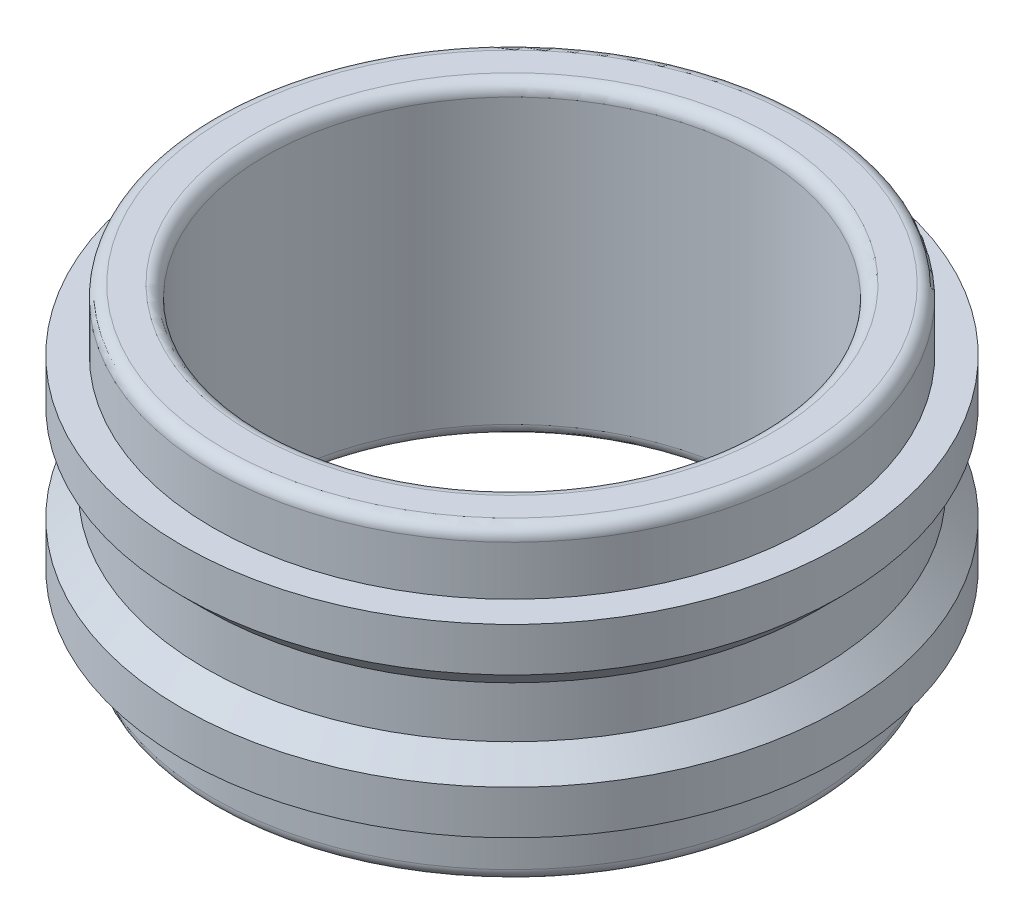
ISO-10303-21;
HEADER;
FILE_DESCRIPTION(('STEP AP214'),'2;1');
FILE_NAME('part.step','',(''),(''),'','','');
FILE_SCHEMA(('AUTOMOTIVE_DESIGN { 1 0 10303 214 1 1 1 1 }'));
ENDSEC;
DATA;
#1=APPLICATION_CONTEXT('core data for automotive mechanical design processes');
#2=APPLICATION_PROTOCOL_DEFINITION('international standard','automotive_design',2000,#1);
#3=PRODUCT_CONTEXT('',#1,'mechanical');
#4=PRODUCT('Part','Part','',(#3));
#5=PRODUCT_RELATED_PRODUCT_CATEGORY('part','',(#4));
#6=PRODUCT_DEFINITION_FORMATION('','',#4);
#7=PRODUCT_DEFINITION_CONTEXT('part definition',#1,'design');
#8=PRODUCT_DEFINITION('design','',#6,#7);
#9=PRODUCT_DEFINITION_SHAPE('','',#8);
#10=(LENGTH_UNIT() NAMED_UNIT(*) SI_UNIT(.MILLI.,.METRE.));
#11=(NAMED_UNIT(*) PLANE_ANGLE_UNIT() SI_UNIT($,.RADIAN.));
#12=(NAMED_UNIT(*) SI_UNIT($,.STERADIAN.) SOLID_ANGLE_UNIT());
#13=UNCERTAINTY_MEASURE_WITH_UNIT(LENGTH_MEASURE(1.E-05),#10,'distance_accuracy_value','');
#14=(GEOMETRIC_REPRESENTATION_CONTEXT(3) GLOBAL_UNCERTAINTY_ASSIGNED_CONTEXT((#13)) GLOBAL_UNIT_ASSIGNED_CONTEXT((#10,
#11,#12)) REPRESENTATION_CONTEXT('',''));
#15=CARTESIAN_POINT('',(0.,0.,0.));
#16=DIRECTION('',(0.,0.,1.));
#17=DIRECTION('',(1.,0.,0.));
#18=AXIS2_PLACEMENT_3D('',#15,#16,#17);
#19=CARTESIAN_POINT('',(0.,5.,0.));
#20=DIRECTION('',(0.,-1.,0.));
#21=DIRECTION('',(0.,0.,-1.));
#22=AXIS2_PLACEMENT_3D('',#19,#20,#21);
#23=CYLINDRICAL_SURFACE('',#22,5.35);
#24=CARTESIAN_POINT('',(0.,1.,0.));
#25=DIRECTION('',(0.,1.,0.));
#26=DIRECTION('',(0.,0.,1.));
#27=AXIS2_PLACEMENT_3D('',#24,#25,#26);
#28=CIRCLE('',#27,5.35);
#29=CARTESIAN_POINT('',(0.,1.,5.35));
#30=VERTEX_POINT('',#29);
#31=EDGE_CURVE('E82',#30,#30,#28,.T.);
#32=ORIENTED_EDGE('',*,*,#31,.T.);
#33=EDGE_LOOP('',(#32));
#34=FACE_BOUND('',#33,.T.);
#35=CARTESIAN_POINT('',(0.,1.7107864376269,0.));
#36=DIRECTION('',(0.,-1.,0.));
#37=DIRECTION('',(0.,0.,-1.));
#38=AXIS2_PLACEMENT_3D('',#35,#36,#37);
#39=CIRCLE('',#38,5.35);
#40=CARTESIAN_POINT('',(0.,1.7107864376269,-5.35));
#41=VERTEX_POINT('',#40);
#42=EDGE_CURVE('E69',#41,#41,#39,.F.);
#43=ORIENTED_EDGE('',*,*,#42,.F.);
#44=EDGE_LOOP('',(#43));
#45=FACE_BOUND('',#44,.T.);
#46=ADVANCED_FACE('F36',(#34,#45),#23,.T.);
#47=CARTESIAN_POINT('',(0.,4.,0.));
#48=DIRECTION('',(0.,1.,0.));
#49=DIRECTION('',(0.,0.,1.));
#50=AXIS2_PLACEMENT_3D('',#47,#48,#49);
#51=CIRCLE('',#50,5.35);
#52=CARTESIAN_POINT('',(0.,4.,5.35));
#53=VERTEX_POINT('',#52);
#54=EDGE_CURVE('E68',#53,#53,#51,.T.);
#55=ORIENTED_EDGE('',*,*,#54,.F.);
#56=EDGE_LOOP('',(#55));
#57=FACE_BOUND('',#56,.T.);
#58=CARTESIAN_POINT('',(0.,3.28921356237309,0.));
#59=DIRECTION('',(0.,1.,0.));
#60=DIRECTION('',(0.,0.,1.));
#61=AXIS2_PLACEMENT_3D('',#58,#59,#60);
#62=CIRCLE('',#61,5.35);
#63=CARTESIAN_POINT('',(0.,3.28921356237309,5.35));
#64=VERTEX_POINT('',#63);
#65=EDGE_CURVE('E73',#64,#64,#62,.F.);
#66=ORIENTED_EDGE('',*,*,#65,.F.);
#67=EDGE_LOOP('',(#66));
#68=FACE_BOUND('',#67,.T.);
#69=ADVANCED_FACE('F103',(#57,#68),#23,.T.);
#70=CARTESIAN_POINT('',(0.,0.,0.));
#71=DIRECTION('',(0.,1.,0.));
#72=DIRECTION('',(0.,0.,1.));
#73=AXIS2_PLACEMENT_3D('',#70,#71,#72);
#74=PLANE('',#73);
#75=CARTESIAN_POINT('',(0.,0.,0.));
#76=DIRECTION('',(0.,1.,0.));
#77=DIRECTION('',(0.,0.,1.));
#78=AXIS2_PLACEMENT_3D('',#75,#76,#77);
#79=CIRCLE('',#78,4.2);
#80=CARTESIAN_POINT('',(0.,0.,4.2));
#81=VERTEX_POINT('',#80);
#82=EDGE_CURVE('E62',#81,#81,#79,.T.);
#83=ORIENTED_EDGE('',*,*,#82,.T.);
#84=EDGE_LOOP('',(#83));
#85=FACE_BOUND('',#84,.T.);
#86=CARTESIAN_POINT('',(0.,0.,0.));
#87=DIRECTION('',(0.,1.,0.));
#88=DIRECTION('',(0.,0.,1.));
#89=AXIS2_PLACEMENT_3D('',#86,#87,#88);
#90=CIRCLE('',#89,4.65);
#91=CARTESIAN_POINT('',(0.,0.,4.65));
#92=VERTEX_POINT('',#91);
#93=EDGE_CURVE('E65',#92,#92,#90,.F.);
#94=ORIENTED_EDGE('',*,*,#93,.T.);
#95=EDGE_LOOP('',(#94));
#96=FACE_BOUND('',#95,.T.);
#97=ADVANCED_FACE('F105',(#85,#96),#74,.F.);
#98=CARTESIAN_POINT('',(0.,5.,0.));
#99=DIRECTION('',(0.,1.,0.));
#100=DIRECTION('',(0.,0.,1.));
#101=AXIS2_PLACEMENT_3D('',#98,#99,#100);
#102=PLANE('',#101);
#103=CARTESIAN_POINT('',(0.,5.,0.));
#104=DIRECTION('',(0.,1.,0.));
#105=DIRECTION('',(0.,0.,1.));
#106=AXIS2_PLACEMENT_3D('',#103,#104,#105);
#107=CIRCLE('',#106,4.2);
#108=CARTESIAN_POINT('',(0.,5.,4.2));
#109=VERTEX_POINT('',#108);
#110=EDGE_CURVE('E43',#109,#109,#107,.F.);
#111=ORIENTED_EDGE('',*,*,#110,.T.);
#112=EDGE_LOOP('',(#111));
#113=FACE_BOUND('',#112,.T.);
#114=CARTESIAN_POINT('',(0.,5.,0.));
#115=DIRECTION('',(0.,1.,0.));
#116=DIRECTION('',(0.,0.,1.));
#117=AXIS2_PLACEMENT_3D('',#114,#115,#116);
#118=CIRCLE('',#117,4.65);
#119=CARTESIAN_POINT('',(0.,5.,4.65));
#120=VERTEX_POINT('',#119);
#121=EDGE_CURVE('E47',#120,#120,#118,.T.);
#122=ORIENTED_EDGE('',*,*,#121,.T.);
#123=EDGE_LOOP('',(#122));
#124=FACE_BOUND('',#123,.T.);
#125=ADVANCED_FACE('F112',(#113,#124),#102,.T.);
#126=CARTESIAN_POINT('',(0.,5.,0.));
#127=DIRECTION('',(0.,-1.,0.));
#128=DIRECTION('',(0.,0.,-1.));
#129=AXIS2_PLACEMENT_3D('',#126,#127,#128);
#130=CYLINDRICAL_SURFACE('',#129,4.);
#131=CARTESIAN_POINT('',(0.,0.2,0.));
#132=DIRECTION('',(0.,1.,0.));
#133=DIRECTION('',(0.,0.,1.));
#134=AXIS2_PLACEMENT_3D('',#131,#132,#133);
#135=CIRCLE('',#134,4.);
#136=CARTESIAN_POINT('',(0.,0.2,4.));
#137=VERTEX_POINT('',#136);
#138=EDGE_CURVE('E56',#137,#137,#135,.F.);
#139=ORIENTED_EDGE('',*,*,#138,.T.);
#140=EDGE_LOOP('',(#139));
#141=FACE_BOUND('',#140,.T.);
#142=CARTESIAN_POINT('',(0.,4.8,0.));
#143=DIRECTION('',(0.,1.,0.));
#144=DIRECTION('',(0.,0.,1.));
#145=AXIS2_PLACEMENT_3D('',#142,#143,#144);
#146=CIRCLE('',#145,4.);
#147=CARTESIAN_POINT('',(0.,4.8,4.));
#148=VERTEX_POINT('',#147);
#149=EDGE_CURVE('E59',#148,#148,#146,.T.);
#150=ORIENTED_EDGE('',*,*,#149,.T.);
#151=EDGE_LOOP('',(#150));
#152=FACE_BOUND('',#151,.T.);
#153=ADVANCED_FACE('F136',(#141,#152),#130,.F.);
#154=CARTESIAN_POINT('',(0.,4.,0.));
#155=DIRECTION('',(0.,1.,0.));
#156=DIRECTION('',(0.,0.,1.));
#157=AXIS2_PLACEMENT_3D('',#154,#155,#156);
#158=PLANE('',#157);
#159=CARTESIAN_POINT('',(0.,4.,0.));
#160=DIRECTION('',(0.,1.,0.));
#161=DIRECTION('',(0.,0.,1.));
#162=AXIS2_PLACEMENT_3D('',#159,#160,#161);
#163=CIRCLE('',#162,4.85);
#164=CARTESIAN_POINT('',(0.,4.,4.85));
#165=VERTEX_POINT('',#164);
#166=EDGE_CURVE('E79',#165,#165,#163,.T.);
#167=ORIENTED_EDGE('',*,*,#166,.F.);
#168=EDGE_LOOP('',(#167));
#169=FACE_BOUND('',#168,.T.);
#170=ORIENTED_EDGE('',*,*,#54,.T.);
#171=EDGE_LOOP('',(#170));
#172=FACE_BOUND('',#171,.T.);
#173=ADVANCED_FACE('F138',(#169,#172),#158,.T.);
#174=CARTESIAN_POINT('',(0.,4.,0.));
#175=DIRECTION('',(0.,1.,0.));
#176=DIRECTION('',(0.,0.,1.));
#177=AXIS2_PLACEMENT_3D('',#174,#175,#176);
#178=CYLINDRICAL_SURFACE('',#177,4.85);
#179=CARTESIAN_POINT('',(0.,4.8,0.));
#180=DIRECTION('',(0.,1.,0.));
#181=DIRECTION('',(0.,0.,1.));
#182=AXIS2_PLACEMENT_3D('',#179,#180,#181);
#183=CIRCLE('',#182,4.85);
#184=CARTESIAN_POINT('',(0.,4.8,4.85));
#185=VERTEX_POINT('',#184);
#186=EDGE_CURVE('E10',#185,#185,#183,.F.);
#187=ORIENTED_EDGE('',*,*,#186,.T.);
#188=EDGE_LOOP('',(#187));
#189=FACE_BOUND('',#188,.T.);
#190=ORIENTED_EDGE('',*,*,#166,.T.);
#191=EDGE_LOOP('',(#190));
#192=FACE_BOUND('',#191,.T.);
#193=ADVANCED_FACE('F145',(#189,#192),#178,.T.);
#194=CARTESIAN_POINT('',(0.,1.,0.));
#195=DIRECTION('',(0.,1.,0.));
#196=DIRECTION('',(0.,0.,1.));
#197=AXIS2_PLACEMENT_3D('',#194,#195,#196);
#198=PLANE('',#197);
#199=CARTESIAN_POINT('',(0.,1.,0.));
#200=DIRECTION('',(0.,1.,0.));
#201=DIRECTION('',(0.,0.,1.));
#202=AXIS2_PLACEMENT_3D('',#199,#200,#201);
#203=CIRCLE('',#202,4.85);
#204=CARTESIAN_POINT('',(0.,1.,4.85));
#205=VERTEX_POINT('',#204);
#206=EDGE_CURVE('E72',#205,#205,#203,.T.);
#207=ORIENTED_EDGE('',*,*,#206,.T.);
#208=EDGE_LOOP('',(#207));
#209=FACE_BOUND('',#208,.T.);
#210=ORIENTED_EDGE('',*,*,#31,.F.);
#211=EDGE_LOOP('',(#210));
#212=FACE_BOUND('',#211,.T.);
#213=ADVANCED_FACE('F151',(#209,#212),#198,.F.);
#214=CARTESIAN_POINT('',(0.,0.,0.));
#215=DIRECTION('',(0.,1.,0.));
#216=DIRECTION('',(0.,0.,1.));
#217=AXIS2_PLACEMENT_3D('',#214,#215,#216);
#218=CYLINDRICAL_SURFACE('',#217,4.85);
#219=CARTESIAN_POINT('',(0.,0.2,0.));
#220=DIRECTION('',(0.,1.,0.));
#221=DIRECTION('',(0.,0.,1.));
#222=AXIS2_PLACEMENT_3D('',#219,#220,#221);
#223=CIRCLE('',#222,4.85);
#224=CARTESIAN_POINT('',(0.,0.2,4.85));
#225=VERTEX_POINT('',#224);
#226=EDGE_CURVE('E51',#225,#225,#223,.T.);
#227=ORIENTED_EDGE('',*,*,#226,.T.);
#228=EDGE_LOOP('',(#227));
#229=FACE_BOUND('',#228,.T.);
#230=ORIENTED_EDGE('',*,*,#206,.F.);
#231=EDGE_LOOP('',(#230));
#232=FACE_BOUND('',#231,.T.);
#233=ADVANCED_FACE('F154',(#229,#232),#218,.T.);
#234=CARTESIAN_POINT('',(0.,1.5,0.));
#235=DIRECTION('',(0.,-1.,0.));
#236=DIRECTION('',(0.,0.,-1.));
#237=AXIS2_PLACEMENT_3D('',#234,#235,#236);
#238=CONICAL_SURFACE('',#237,5.5607864376269,0.785398163397448);
#239=CARTESIAN_POINT('',(0.,2.08578643762691,0.));
#240=DIRECTION('',(0.,-1.,0.));
#241=DIRECTION('',(0.,0.,-1.));
#242=AXIS2_PLACEMENT_3D('',#239,#240,#241);
#243=CIRCLE('',#242,4.975);
#244=CARTESIAN_POINT('',(0.,2.08578643762691,-4.975));
#245=VERTEX_POINT('',#244);
#246=EDGE_CURVE('E76',#245,#245,#243,.T.);
#247=ORIENTED_EDGE('',*,*,#246,.T.);
#248=EDGE_LOOP('',(#247));
#249=FACE_BOUND('',#248,.T.);
#250=ORIENTED_EDGE('',*,*,#42,.T.);
#251=EDGE_LOOP('',(#250));
#252=FACE_BOUND('',#251,.T.);
#253=ADVANCED_FACE('F99',(#249,#252),#238,.T.);
#254=CARTESIAN_POINT('',(0.,2.91421356237309,0.));
#255=DIRECTION('',(0.,1.,0.));
#256=DIRECTION('',(0.,0.,1.));
#257=AXIS2_PLACEMENT_3D('',#254,#255,#256);
#258=CONICAL_SURFACE('',#257,4.975,0.785398163397447);
#259=CARTESIAN_POINT('',(0.,2.91421356237309,0.));
#260=DIRECTION('',(0.,-1.,0.));
#261=DIRECTION('',(0.,0.,-1.));
#262=AXIS2_PLACEMENT_3D('',#259,#260,#261);
#263=CIRCLE('',#262,4.975);
#264=CARTESIAN_POINT('',(0.,2.91421356237309,-4.975));
#265=VERTEX_POINT('',#264);
#266=EDGE_CURVE('E89',#265,#265,#263,.T.);
#267=ORIENTED_EDGE('',*,*,#266,.F.);
#268=EDGE_LOOP('',(#267));
#269=FACE_BOUND('',#268,.T.);
#270=ORIENTED_EDGE('',*,*,#65,.T.);
#271=EDGE_LOOP('',(#270));
#272=FACE_BOUND('',#271,.T.);
#273=ADVANCED_FACE('F96',(#269,#272),#258,.T.);
#274=CARTESIAN_POINT('',(0.,0.,0.));
#275=DIRECTION('',(0.,-1.,0.));
#276=DIRECTION('',(0.,0.,-1.));
#277=AXIS2_PLACEMENT_3D('',#274,#275,#276);
#278=CYLINDRICAL_SURFACE('',#277,4.975);
#279=ORIENTED_EDGE('',*,*,#266,.T.);
#280=EDGE_LOOP('',(#279));
#281=FACE_BOUND('',#280,.T.);
#282=ORIENTED_EDGE('',*,*,#246,.F.);
#283=EDGE_LOOP('',(#282));
#284=FACE_BOUND('',#283,.T.);
#285=ADVANCED_FACE('F93',(#281,#284),#278,.T.);
#286=CARTESIAN_POINT('',(0.,0.2,0.));
#287=DIRECTION('',(0.,1.,0.));
#288=DIRECTION('',(0.,0.,1.));
#289=AXIS2_PLACEMENT_3D('',#286,#287,#288);
#290=TOROIDAL_SURFACE('',#289,4.2,0.2);
#291=ORIENTED_EDGE('',*,*,#138,.F.);
#292=EDGE_LOOP('',(#291));
#293=FACE_BOUND('',#292,.T.);
#294=ORIENTED_EDGE('',*,*,#82,.F.);
#295=EDGE_LOOP('',(#294));
#296=FACE_BOUND('',#295,.T.);
#297=ADVANCED_FACE('F119',(#293,#296),#290,.T.);
#298=CARTESIAN_POINT('',(0.,0.2,0.));
#299=DIRECTION('',(0.,1.,0.));
#300=DIRECTION('',(0.,0.,1.));
#301=AXIS2_PLACEMENT_3D('',#298,#299,#300);
#302=TOROIDAL_SURFACE('',#301,4.65,0.2);
#303=ORIENTED_EDGE('',*,*,#93,.F.);
#304=EDGE_LOOP('',(#303));
#305=FACE_BOUND('',#304,.T.);
#306=ORIENTED_EDGE('',*,*,#226,.F.);
#307=EDGE_LOOP('',(#306));
#308=FACE_BOUND('',#307,.T.);
#309=ADVANCED_FACE('F122',(#305,#308),#302,.T.);
#310=CARTESIAN_POINT('',(0.,4.8,0.));
#311=DIRECTION('',(0.,1.,0.));
#312=DIRECTION('',(0.,0.,1.));
#313=AXIS2_PLACEMENT_3D('',#310,#311,#312);
#314=TOROIDAL_SURFACE('',#313,4.2,0.2);
#315=ORIENTED_EDGE('',*,*,#110,.F.);
#316=EDGE_LOOP('',(#315));
#317=FACE_BOUND('',#316,.T.);
#318=ORIENTED_EDGE('',*,*,#149,.F.);
#319=EDGE_LOOP('',(#318));
#320=FACE_BOUND('',#319,.T.);
#321=ADVANCED_FACE('F125',(#317,#320),#314,.T.);
#322=CARTESIAN_POINT('',(0.,4.8,0.));
#323=DIRECTION('',(0.,1.,0.));
#324=DIRECTION('',(0.,0.,1.));
#325=AXIS2_PLACEMENT_3D('',#322,#323,#324);
#326=TOROIDAL_SURFACE('',#325,4.65,0.2);
#327=ORIENTED_EDGE('',*,*,#186,.F.);
#328=EDGE_LOOP('',(#327));
#329=FACE_BOUND('',#328,.T.);
#330=ORIENTED_EDGE('',*,*,#121,.F.);
#331=EDGE_LOOP('',(#330));
#332=FACE_BOUND('',#331,.T.);
#333=ADVANCED_FACE('F38',(#329,#332),#326,.T.);
#334=CLOSED_SHELL('',(#46,#69,#97,#125,#153,#173,#193,#213,#233,#253,#273,#285,#297,#309,#321,#333));
#335=MANIFOLD_SOLID_BREP('B2',#334);
#336=ADVANCED_BREP_SHAPE_REPRESENTATION('',(#18,#335),#14);
#337=SHAPE_DEFINITION_REPRESENTATION(#9,#336);
ENDSEC;
END-ISO-10303-21;
